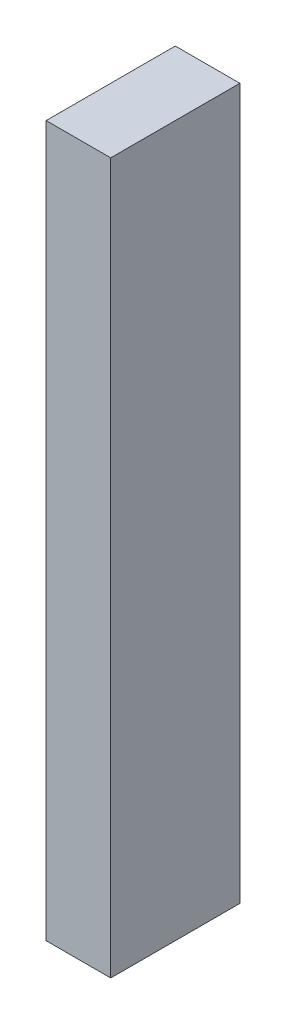
ISO-10303-21;
HEADER;
FILE_DESCRIPTION(('STEP AP214'),'2;1');
FILE_NAME('part.step','',(''),(''),'','','');
FILE_SCHEMA(('AUTOMOTIVE_DESIGN { 1 0 10303 214 1 1 1 1 }'));
ENDSEC;
DATA;
#1=APPLICATION_CONTEXT('core data for automotive mechanical design processes');
#2=APPLICATION_PROTOCOL_DEFINITION('international standard','automotive_design',2000,#1);
#3=PRODUCT_CONTEXT('',#1,'mechanical');
#4=PRODUCT('Part','Part','',(#3));
#5=PRODUCT_RELATED_PRODUCT_CATEGORY('part','',(#4));
#6=PRODUCT_DEFINITION_FORMATION('','',#4);
#7=PRODUCT_DEFINITION_CONTEXT('part definition',#1,'design');
#8=PRODUCT_DEFINITION('design','',#6,#7);
#9=PRODUCT_DEFINITION_SHAPE('','',#8);
#10=(LENGTH_UNIT() NAMED_UNIT(*) SI_UNIT(.MILLI.,.METRE.));
#11=(NAMED_UNIT(*) PLANE_ANGLE_UNIT() SI_UNIT($,.RADIAN.));
#12=(NAMED_UNIT(*) SI_UNIT($,.STERADIAN.) SOLID_ANGLE_UNIT());
#13=UNCERTAINTY_MEASURE_WITH_UNIT(LENGTH_MEASURE(1.E-05),#10,'distance_accuracy_value','');
#14=(GEOMETRIC_REPRESENTATION_CONTEXT(3) GLOBAL_UNCERTAINTY_ASSIGNED_CONTEXT((#13)) GLOBAL_UNIT_ASSIGNED_CONTEXT((#10,
#11,#12)) REPRESENTATION_CONTEXT('',''));
#15=CARTESIAN_POINT('',(0.,0.,0.));
#16=DIRECTION('',(0.,0.,1.));
#17=DIRECTION('',(1.,0.,0.));
#18=AXIS2_PLACEMENT_3D('',#15,#16,#17);
#19=CARTESIAN_POINT('',(0.,279.4,0.));
#20=DIRECTION('',(1.,0.,0.));
#21=DIRECTION('',(0.,0.,-1.));
#22=AXIS2_PLACEMENT_3D('',#19,#20,#21);
#23=PLANE('',#22);
#24=DIRECTION('',(0.,0.,1.));
#25=VECTOR('',#24,1.);
#26=CARTESIAN_POINT('',(0.,0.,0.));
#27=LINE('',#26,#25);
#28=CARTESIAN_POINT('',(0.,0.,-50.8));
#29=VERTEX_POINT('',#28);
#30=CARTESIAN_POINT('',(0.,0.,0.));
#31=VERTEX_POINT('',#30);
#32=EDGE_CURVE('E97',#29,#31,#27,.T.);
#33=ORIENTED_EDGE('',*,*,#32,.T.);
#34=DIRECTION('',(0.,-1.,0.));
#35=VECTOR('',#34,1.);
#36=CARTESIAN_POINT('',(0.,279.4,0.));
#37=LINE('',#36,#35);
#38=CARTESIAN_POINT('',(0.,279.4,0.));
#39=VERTEX_POINT('',#38);
#40=EDGE_CURVE('E11',#39,#31,#37,.T.);
#41=ORIENTED_EDGE('',*,*,#40,.F.);
#42=DIRECTION('',(0.,0.,1.));
#43=VECTOR('',#42,1.);
#44=CARTESIAN_POINT('',(0.,279.4,0.));
#45=LINE('',#44,#43);
#46=CARTESIAN_POINT('',(0.,279.4,-50.8));
#47=VERTEX_POINT('',#46);
#48=EDGE_CURVE('E85',#47,#39,#45,.T.);
#49=ORIENTED_EDGE('',*,*,#48,.F.);
#50=DIRECTION('',(0.,-1.,0.));
#51=VECTOR('',#50,1.);
#52=CARTESIAN_POINT('',(0.,279.4,-50.8));
#53=LINE('',#52,#51);
#54=EDGE_CURVE('E93',#47,#29,#53,.T.);
#55=ORIENTED_EDGE('',*,*,#54,.T.);
#56=EDGE_LOOP('',(#33,#41,#49,#55));
#57=FACE_BOUND('',#56,.T.);
#58=ADVANCED_FACE('F34',(#57),#23,.F.);
#59=CARTESIAN_POINT('',(0.,279.4,0.));
#60=DIRECTION('',(0.,0.,-1.));
#61=DIRECTION('',(-1.,0.,0.));
#62=AXIS2_PLACEMENT_3D('',#59,#60,#61);
#63=PLANE('',#62);
#64=DIRECTION('',(1.,0.,0.));
#65=VECTOR('',#64,1.);
#66=CARTESIAN_POINT('',(0.,0.,0.));
#67=LINE('',#66,#65);
#68=CARTESIAN_POINT('',(25.4,0.,0.));
#69=VERTEX_POINT('',#68);
#70=EDGE_CURVE('E89',#31,#69,#67,.T.);
#71=ORIENTED_EDGE('',*,*,#70,.T.);
#72=DIRECTION('',(0.,-1.,0.));
#73=VECTOR('',#72,1.);
#74=CARTESIAN_POINT('',(25.4,279.4,0.));
#75=LINE('',#74,#73);
#76=CARTESIAN_POINT('',(25.4,279.4,0.));
#77=VERTEX_POINT('',#76);
#78=EDGE_CURVE('E42',#77,#69,#75,.T.);
#79=ORIENTED_EDGE('',*,*,#78,.F.);
#80=DIRECTION('',(1.,0.,0.));
#81=VECTOR('',#80,1.);
#82=CARTESIAN_POINT('',(0.,279.4,0.));
#83=LINE('',#82,#81);
#84=EDGE_CURVE('E80',#39,#77,#83,.T.);
#85=ORIENTED_EDGE('',*,*,#84,.F.);
#86=ORIENTED_EDGE('',*,*,#40,.T.);
#87=EDGE_LOOP('',(#71,#79,#85,#86));
#88=FACE_BOUND('',#87,.T.);
#89=ADVANCED_FACE('F88',(#88),#63,.F.);
#90=CARTESIAN_POINT('',(25.4,279.4,0.));
#91=DIRECTION('',(-1.,0.,0.));
#92=DIRECTION('',(0.,0.,1.));
#93=AXIS2_PLACEMENT_3D('',#90,#91,#92);
#94=PLANE('',#93);
#95=DIRECTION('',(0.,0.,-1.));
#96=VECTOR('',#95,1.);
#97=CARTESIAN_POINT('',(25.4,0.,0.));
#98=LINE('',#97,#96);
#99=CARTESIAN_POINT('',(25.4,0.,-50.8));
#100=VERTEX_POINT('',#99);
#101=EDGE_CURVE('E67',#69,#100,#98,.T.);
#102=ORIENTED_EDGE('',*,*,#101,.T.);
#103=DIRECTION('',(0.,-1.,0.));
#104=VECTOR('',#103,1.);
#105=CARTESIAN_POINT('',(25.4,279.4,-50.8));
#106=LINE('',#105,#104);
#107=CARTESIAN_POINT('',(25.4,279.4,-50.8));
#108=VERTEX_POINT('',#107);
#109=EDGE_CURVE('E90',#108,#100,#106,.T.);
#110=ORIENTED_EDGE('',*,*,#109,.F.);
#111=DIRECTION('',(0.,0.,-1.));
#112=VECTOR('',#111,1.);
#113=CARTESIAN_POINT('',(25.4,279.4,0.));
#114=LINE('',#113,#112);
#115=EDGE_CURVE('E83',#77,#108,#114,.T.);
#116=ORIENTED_EDGE('',*,*,#115,.F.);
#117=ORIENTED_EDGE('',*,*,#78,.T.);
#118=EDGE_LOOP('',(#102,#110,#116,#117));
#119=FACE_BOUND('',#118,.T.);
#120=ADVANCED_FACE('F91',(#119),#94,.F.);
#121=CARTESIAN_POINT('',(0.,279.4,-50.8));
#122=DIRECTION('',(0.,0.,1.));
#123=DIRECTION('',(1.,0.,0.));
#124=AXIS2_PLACEMENT_3D('',#121,#122,#123);
#125=PLANE('',#124);
#126=DIRECTION('',(-1.,0.,0.));
#127=VECTOR('',#126,1.);
#128=CARTESIAN_POINT('',(0.,0.,-50.8));
#129=LINE('',#128,#127);
#130=EDGE_CURVE('E73',#100,#29,#129,.T.);
#131=ORIENTED_EDGE('',*,*,#130,.T.);
#132=ORIENTED_EDGE('',*,*,#54,.F.);
#133=DIRECTION('',(-1.,0.,0.));
#134=VECTOR('',#133,1.);
#135=CARTESIAN_POINT('',(0.,279.4,-50.8));
#136=LINE('',#135,#134);
#137=EDGE_CURVE('E50',#108,#47,#136,.T.);
#138=ORIENTED_EDGE('',*,*,#137,.F.);
#139=ORIENTED_EDGE('',*,*,#109,.T.);
#140=EDGE_LOOP('',(#131,#132,#138,#139));
#141=FACE_BOUND('',#140,.T.);
#142=ADVANCED_FACE('F104',(#141),#125,.F.);
#143=CARTESIAN_POINT('',(0.,279.4,0.));
#144=DIRECTION('',(0.,-1.,0.));
#145=DIRECTION('',(0.,0.,-1.));
#146=AXIS2_PLACEMENT_3D('',#143,#144,#145);
#147=PLANE('',#146);
#148=ORIENTED_EDGE('',*,*,#48,.T.);
#149=ORIENTED_EDGE('',*,*,#84,.T.);
#150=ORIENTED_EDGE('',*,*,#115,.T.);
#151=ORIENTED_EDGE('',*,*,#137,.T.);
#152=EDGE_LOOP('',(#148,#149,#150,#151));
#153=FACE_BOUND('',#152,.T.);
#154=ADVANCED_FACE('F81',(#153),#147,.F.);
#155=CARTESIAN_POINT('',(0.,0.,0.));
#156=DIRECTION('',(0.,-1.,0.));
#157=DIRECTION('',(0.,0.,-1.));
#158=AXIS2_PLACEMENT_3D('',#155,#156,#157);
#159=PLANE('',#158);
#160=ORIENTED_EDGE('',*,*,#32,.F.);
#161=ORIENTED_EDGE('',*,*,#130,.F.);
#162=ORIENTED_EDGE('',*,*,#101,.F.);
#163=ORIENTED_EDGE('',*,*,#70,.F.);
#164=EDGE_LOOP('',(#160,#161,#162,#163));
#165=FACE_BOUND('',#164,.T.);
#166=ADVANCED_FACE('F107',(#165),#159,.T.);
#167=CLOSED_SHELL('',(#58,#89,#120,#142,#154,#166));
#168=MANIFOLD_SOLID_BREP('B2',#167);
#169=ADVANCED_BREP_SHAPE_REPRESENTATION('',(#18,#168),#14);
#170=SHAPE_DEFINITION_REPRESENTATION(#9,#169);
ENDSEC;
END-ISO-10303-21;
